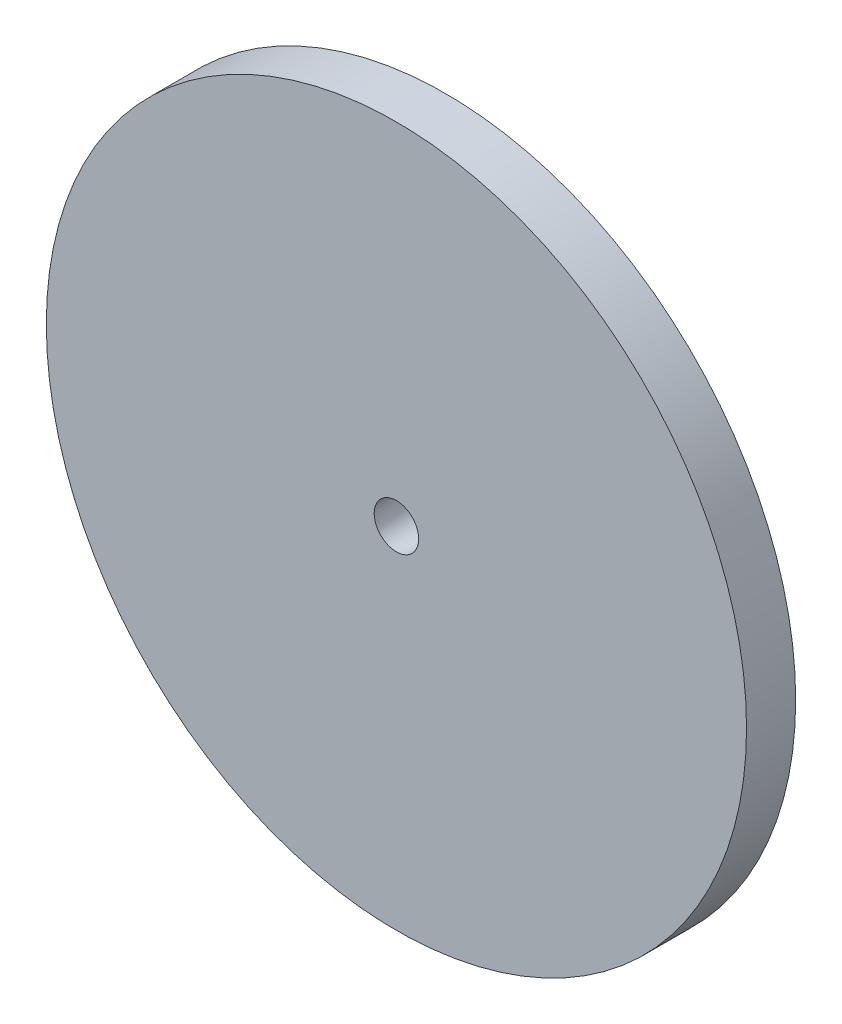
ISO-10303-21;
HEADER;
FILE_DESCRIPTION(('STEP AP214'),'2;1');
FILE_NAME('part.step','',(''),(''),'','','');
FILE_SCHEMA(('AUTOMOTIVE_DESIGN { 1 0 10303 214 1 1 1 1 }'));
ENDSEC;
DATA;
#1=APPLICATION_CONTEXT('core data for automotive mechanical design processes');
#2=APPLICATION_PROTOCOL_DEFINITION('international standard','automotive_design',2000,#1);
#3=PRODUCT_CONTEXT('',#1,'mechanical');
#4=PRODUCT('Part','Part','',(#3));
#5=PRODUCT_RELATED_PRODUCT_CATEGORY('part','',(#4));
#6=PRODUCT_DEFINITION_FORMATION('','',#4);
#7=PRODUCT_DEFINITION_CONTEXT('part definition',#1,'design');
#8=PRODUCT_DEFINITION('design','',#6,#7);
#9=PRODUCT_DEFINITION_SHAPE('','',#8);
#10=(LENGTH_UNIT() NAMED_UNIT(*) SI_UNIT(.MILLI.,.METRE.));
#11=(NAMED_UNIT(*) PLANE_ANGLE_UNIT() SI_UNIT($,.RADIAN.));
#12=(NAMED_UNIT(*) SI_UNIT($,.STERADIAN.) SOLID_ANGLE_UNIT());
#13=UNCERTAINTY_MEASURE_WITH_UNIT(LENGTH_MEASURE(1.E-05),#10,'distance_accuracy_value','');
#14=(GEOMETRIC_REPRESENTATION_CONTEXT(3) GLOBAL_UNCERTAINTY_ASSIGNED_CONTEXT((#13)) GLOBAL_UNIT_ASSIGNED_CONTEXT((#10,
#11,#12)) REPRESENTATION_CONTEXT('',''));
#15=CARTESIAN_POINT('',(0.,0.,0.));
#16=DIRECTION('',(0.,0.,1.));
#17=DIRECTION('',(1.,0.,0.));
#18=AXIS2_PLACEMENT_3D('',#15,#16,#17);
#19=CARTESIAN_POINT('',(0.,0.,5.334));
#20=DIRECTION('',(0.,0.,-1.));
#21=DIRECTION('',(-1.,0.,0.));
#22=AXIS2_PLACEMENT_3D('',#19,#20,#21);
#23=CYLINDRICAL_SURFACE('',#22,38.000051);
#24=CARTESIAN_POINT('',(0.,0.,5.334));
#25=DIRECTION('',(0.,0.,1.));
#26=DIRECTION('',(1.,0.,0.));
#27=AXIS2_PLACEMENT_3D('',#24,#25,#26);
#28=CIRCLE('',#27,38.000051);
#29=CARTESIAN_POINT('',(38.000051,0.,5.334));
#30=VERTEX_POINT('',#29);
#31=EDGE_CURVE('E10',#30,#30,#28,.T.);
#32=ORIENTED_EDGE('',*,*,#31,.F.);
#33=EDGE_LOOP('',(#32));
#34=FACE_BOUND('',#33,.T.);
#35=CARTESIAN_POINT('',(0.,0.,0.));
#36=DIRECTION('',(0.,0.,1.));
#37=DIRECTION('',(1.,0.,0.));
#38=AXIS2_PLACEMENT_3D('',#35,#36,#37);
#39=CIRCLE('',#38,38.000051);
#40=CARTESIAN_POINT('',(38.000051,0.,0.));
#41=VERTEX_POINT('',#40);
#42=EDGE_CURVE('E40',#41,#41,#39,.T.);
#43=ORIENTED_EDGE('',*,*,#42,.T.);
#44=EDGE_LOOP('',(#43));
#45=FACE_BOUND('',#44,.T.);
#46=ADVANCED_FACE('F37',(#34,#45),#23,.T.);
#47=CARTESIAN_POINT('',(0.,0.,5.334));
#48=DIRECTION('',(0.,0.,1.));
#49=DIRECTION('',(1.,0.,0.));
#50=AXIS2_PLACEMENT_3D('',#47,#48,#49);
#51=PLANE('',#50);
#52=CARTESIAN_POINT('',(0.,0.,5.334));
#53=DIRECTION('',(0.,0.,1.));
#54=DIRECTION('',(1.,0.,0.));
#55=AXIS2_PLACEMENT_3D('',#52,#53,#54);
#56=CIRCLE('',#55,2.413);
#57=CARTESIAN_POINT('',(2.413,0.,5.334));
#58=VERTEX_POINT('',#57);
#59=EDGE_CURVE('E52',#58,#58,#56,.T.);
#60=ORIENTED_EDGE('',*,*,#59,.F.);
#61=EDGE_LOOP('',(#60));
#62=FACE_BOUND('',#61,.T.);
#63=ORIENTED_EDGE('',*,*,#31,.T.);
#64=EDGE_LOOP('',(#63));
#65=FACE_BOUND('',#64,.T.);
#66=ADVANCED_FACE('F70',(#62,#65),#51,.T.);
#67=CARTESIAN_POINT('',(0.,0.,0.));
#68=DIRECTION('',(0.,0.,1.));
#69=DIRECTION('',(1.,0.,0.));
#70=AXIS2_PLACEMENT_3D('',#67,#68,#69);
#71=PLANE('',#70);
#72=CARTESIAN_POINT('',(0.,0.,0.));
#73=DIRECTION('',(0.,0.,1.));
#74=DIRECTION('',(1.,0.,0.));
#75=AXIS2_PLACEMENT_3D('',#72,#73,#74);
#76=CIRCLE('',#75,2.413);
#77=CARTESIAN_POINT('',(2.413,0.,0.));
#78=VERTEX_POINT('',#77);
#79=EDGE_CURVE('E50',#78,#78,#76,.T.);
#80=ORIENTED_EDGE('',*,*,#79,.T.);
#81=EDGE_LOOP('',(#80));
#82=FACE_BOUND('',#81,.T.);
#83=ORIENTED_EDGE('',*,*,#42,.F.);
#84=EDGE_LOOP('',(#83));
#85=FACE_BOUND('',#84,.T.);
#86=ADVANCED_FACE('F61',(#82,#85),#71,.F.);
#87=CARTESIAN_POINT('',(0.,0.,0.));
#88=DIRECTION('',(0.,0.,1.));
#89=DIRECTION('',(1.,0.,0.));
#90=AXIS2_PLACEMENT_3D('',#87,#88,#89);
#91=CYLINDRICAL_SURFACE('',#90,2.413);
#92=ORIENTED_EDGE('',*,*,#79,.F.);
#93=EDGE_LOOP('',(#92));
#94=FACE_BOUND('',#93,.T.);
#95=ORIENTED_EDGE('',*,*,#59,.T.);
#96=EDGE_LOOP('',(#95));
#97=FACE_BOUND('',#96,.T.);
#98=ADVANCED_FACE('F64',(#94,#97),#91,.F.);
#99=CLOSED_SHELL('',(#46,#66,#86,#98));
#100=MANIFOLD_SOLID_BREP('B2',#99);
#101=ADVANCED_BREP_SHAPE_REPRESENTATION('',(#18,#100),#14);
#102=SHAPE_DEFINITION_REPRESENTATION(#9,#101);
ENDSEC;
END-ISO-10303-21;
